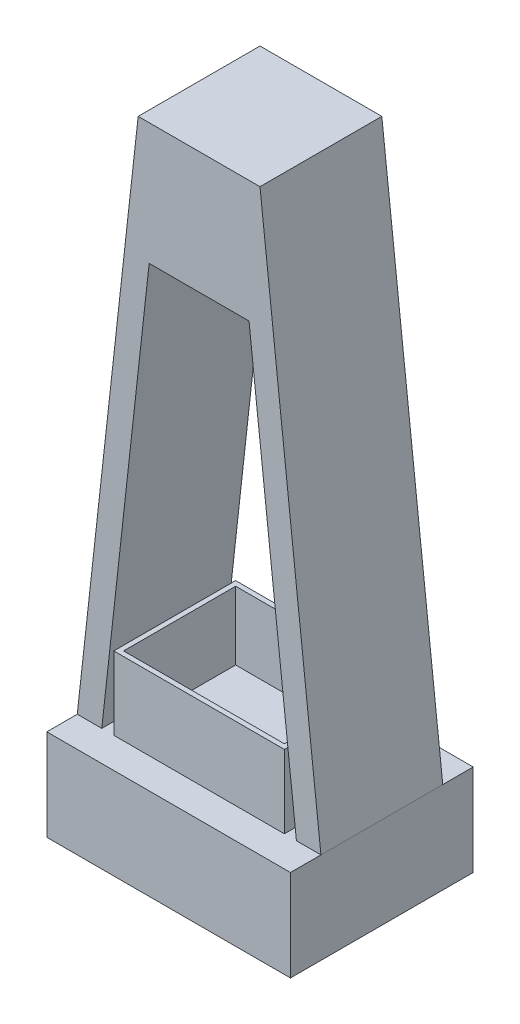
ISO-10303-21;
HEADER;
FILE_DESCRIPTION(('STEP AP214'),'2;1');
FILE_NAME('part.step','',(''),(''),'','','');
FILE_SCHEMA(('AUTOMOTIVE_DESIGN { 1 0 10303 214 1 1 1 1 }'));
ENDSEC;
DATA;
#1=APPLICATION_CONTEXT('core data for automotive mechanical design processes');
#2=APPLICATION_PROTOCOL_DEFINITION('international standard','automotive_design',2000,#1);
#3=PRODUCT_CONTEXT('',#1,'mechanical');
#4=PRODUCT('Part','Part','',(#3));
#5=PRODUCT_RELATED_PRODUCT_CATEGORY('part','',(#4));
#6=PRODUCT_DEFINITION_FORMATION('','',#4);
#7=PRODUCT_DEFINITION_CONTEXT('part definition',#1,'design');
#8=PRODUCT_DEFINITION('design','',#6,#7);
#9=PRODUCT_DEFINITION_SHAPE('','',#8);
#10=(LENGTH_UNIT() NAMED_UNIT(*) SI_UNIT(.MILLI.,.METRE.));
#11=(NAMED_UNIT(*) PLANE_ANGLE_UNIT() SI_UNIT($,.RADIAN.));
#12=(NAMED_UNIT(*) SI_UNIT($,.STERADIAN.) SOLID_ANGLE_UNIT());
#13=UNCERTAINTY_MEASURE_WITH_UNIT(LENGTH_MEASURE(1.E-05),#10,'distance_accuracy_value','');
#14=(GEOMETRIC_REPRESENTATION_CONTEXT(3) GLOBAL_UNCERTAINTY_ASSIGNED_CONTEXT((#13)) GLOBAL_UNIT_ASSIGNED_CONTEXT((#10,
#11,#12)) REPRESENTATION_CONTEXT('',''));
#15=CARTESIAN_POINT('',(0.,0.,0.));
#16=DIRECTION('',(0.,0.,1.));
#17=DIRECTION('',(1.,0.,0.));
#18=AXIS2_PLACEMENT_3D('',#15,#16,#17);
#19=CARTESIAN_POINT('',(0.,-225.,0.));
#20=DIRECTION('',(0.,1.,0.));
#21=DIRECTION('',(0.,0.,1.));
#22=AXIS2_PLACEMENT_3D('',#19,#20,#21);
#23=PLANE('',#22);
#24=DIRECTION('',(0.,0.,-1.));
#25=VECTOR('',#24,1.);
#26=CARTESIAN_POINT('',(-100.,-225.,-25.));
#27=LINE('',#26,#25);
#28=CARTESIAN_POINT('',(-100.,-225.,125.));
#29=VERTEX_POINT('',#28);
#30=CARTESIAN_POINT('',(-100.,-225.,100.));
#31=VERTEX_POINT('',#30);
#32=EDGE_CURVE('E280',#29,#31,#27,.T.);
#33=ORIENTED_EDGE('',*,*,#32,.F.);
#34=DIRECTION('',(-1.,0.,0.));
#35=VECTOR('',#34,1.);
#36=CARTESIAN_POINT('',(-100.,-225.,125.));
#37=LINE('',#36,#35);
#38=CARTESIAN_POINT('',(99.9999999999999,-225.,125.));
#39=VERTEX_POINT('',#38);
#40=EDGE_CURVE('E277',#39,#29,#37,.T.);
#41=ORIENTED_EDGE('',*,*,#40,.F.);
#42=DIRECTION('',(0.,0.,1.));
#43=VECTOR('',#42,1.);
#44=CARTESIAN_POINT('',(99.9999999999999,-225.,-25.));
#45=LINE('',#44,#43);
#46=CARTESIAN_POINT('',(100.,-225.,100.));
#47=VERTEX_POINT('',#46);
#48=EDGE_CURVE('E262',#47,#39,#45,.T.);
#49=ORIENTED_EDGE('',*,*,#48,.F.);
#50=DIRECTION('',(1.,0.,0.));
#51=VECTOR('',#50,1.);
#52=CARTESIAN_POINT('',(100.,-225.,100.));
#53=LINE('',#52,#51);
#54=CARTESIAN_POINT('',(79.8769219152501,-225.,100.));
#55=VERTEX_POINT('',#54);
#56=EDGE_CURVE('E299',#55,#47,#53,.T.);
#57=ORIENTED_EDGE('',*,*,#56,.F.);
#58=DIRECTION('',(0.,0.,-1.));
#59=VECTOR('',#58,1.);
#60=CARTESIAN_POINT('',(79.8769219152501,-225.,125.));
#61=LINE('',#60,#59);
#62=CARTESIAN_POINT('',(79.8769219152501,-225.,0.));
#63=VERTEX_POINT('',#62);
#64=EDGE_CURVE('E244',#55,#63,#61,.T.);
#65=ORIENTED_EDGE('',*,*,#64,.T.);
#66=DIRECTION('',(1.,0.,0.));
#67=VECTOR('',#66,1.);
#68=CARTESIAN_POINT('',(100.,-225.,0.));
#69=LINE('',#68,#67);
#70=CARTESIAN_POINT('',(99.9999999999999,-225.,0.));
#71=VERTEX_POINT('',#70);
#72=EDGE_CURVE('E311',#63,#71,#69,.T.);
#73=ORIENTED_EDGE('',*,*,#72,.T.);
#74=CARTESIAN_POINT('',(99.9999999999999,-225.,-25.));
#75=VERTEX_POINT('',#74);
#76=EDGE_CURVE('E274',#75,#71,#45,.T.);
#77=ORIENTED_EDGE('',*,*,#76,.F.);
#78=DIRECTION('',(1.,0.,0.));
#79=VECTOR('',#78,1.);
#80=CARTESIAN_POINT('',(-100.,-225.,-25.));
#81=LINE('',#80,#79);
#82=CARTESIAN_POINT('',(-100.,-225.,-25.));
#83=VERTEX_POINT('',#82);
#84=EDGE_CURVE('E267',#83,#75,#81,.T.);
#85=ORIENTED_EDGE('',*,*,#84,.F.);
#86=CARTESIAN_POINT('',(-100.,-225.,0.));
#87=VERTEX_POINT('',#86);
#88=EDGE_CURVE('E279',#87,#83,#27,.T.);
#89=ORIENTED_EDGE('',*,*,#88,.F.);
#90=CARTESIAN_POINT('',(-79.8769219152502,-225.,0.));
#91=VERTEX_POINT('',#90);
#92=EDGE_CURVE('E312',#87,#91,#69,.T.);
#93=ORIENTED_EDGE('',*,*,#92,.T.);
#94=DIRECTION('',(0.,0.,-1.));
#95=VECTOR('',#94,1.);
#96=CARTESIAN_POINT('',(-79.8769219152502,-225.,125.));
#97=LINE('',#96,#95);
#98=CARTESIAN_POINT('',(-79.8769219152502,-225.,100.));
#99=VERTEX_POINT('',#98);
#100=EDGE_CURVE('E250',#99,#91,#97,.T.);
#101=ORIENTED_EDGE('',*,*,#100,.F.);
#102=EDGE_CURVE('E301',#31,#99,#53,.T.);
#103=ORIENTED_EDGE('',*,*,#102,.F.);
#104=EDGE_LOOP('',(#33,#41,#49,#57,#65,#73,#77,#85,#89,#93,#101,#103));
#105=FACE_BOUND('',#104,.T.);
#106=DIRECTION('',(0.,0.,-1.));
#107=VECTOR('',#106,1.);
#108=CARTESIAN_POINT('',(-70.,-225.,252.315462117278));
#109=LINE('',#108,#107);
#110=CARTESIAN_POINT('',(-70.,-225.,100.));
#111=VERTEX_POINT('',#110);
#112=CARTESIAN_POINT('',(-70.,-225.,0.));
#113=VERTEX_POINT('',#112);
#114=EDGE_CURVE('E59',#111,#113,#109,.T.);
#115=ORIENTED_EDGE('',*,*,#114,.T.);
#116=DIRECTION('',(-1.,0.,0.));
#117=VECTOR('',#116,1.);
#118=CARTESIAN_POINT('',(70.,-225.,0.));
#119=LINE('',#118,#117);
#120=CARTESIAN_POINT('',(70.,-225.,0.));
#121=VERTEX_POINT('',#120);
#122=EDGE_CURVE('E220',#121,#113,#119,.T.);
#123=ORIENTED_EDGE('',*,*,#122,.F.);
#124=DIRECTION('',(0.,0.,-1.));
#125=VECTOR('',#124,1.);
#126=CARTESIAN_POINT('',(70.,-225.,252.315462117278));
#127=LINE('',#126,#125);
#128=CARTESIAN_POINT('',(70.,-225.,100.));
#129=VERTEX_POINT('',#128);
#130=EDGE_CURVE('E229',#129,#121,#127,.T.);
#131=ORIENTED_EDGE('',*,*,#130,.F.);
#132=DIRECTION('',(1.,0.,0.));
#133=VECTOR('',#132,1.);
#134=CARTESIAN_POINT('',(70.,-225.,100.));
#135=LINE('',#134,#133);
#136=EDGE_CURVE('E217',#111,#129,#135,.T.);
#137=ORIENTED_EDGE('',*,*,#136,.F.);
#138=EDGE_LOOP('',(#115,#123,#131,#137));
#139=FACE_BOUND('',#138,.T.);
#140=ADVANCED_FACE('F36',(#105,#139),#23,.T.);
#141=CARTESIAN_POINT('',(-100.,-225.,100.));
#142=DIRECTION('',(0.993883734673619,-0.110431526074847,0.));
#143=DIRECTION('',(0.110431526074847,0.993883734673619,0.));
#144=AXIS2_PLACEMENT_3D('',#141,#142,#143);
#145=PLANE('',#144);
#146=DIRECTION('',(-0.110431526074847,-0.993883734673619,0.));
#147=VECTOR('',#146,1.);
#148=CARTESIAN_POINT('',(-100.,-225.,0.));
#149=LINE('',#148,#147);
#150=CARTESIAN_POINT('',(-50.,225.,0.));
#151=VERTEX_POINT('',#150);
#152=EDGE_CURVE('E295',#151,#87,#149,.T.);
#153=ORIENTED_EDGE('',*,*,#152,.T.);
#154=DIRECTION('',(0.,0.,-1.));
#155=VECTOR('',#154,1.);
#156=CARTESIAN_POINT('',(-100.,-225.,100.));
#157=LINE('',#156,#155);
#158=EDGE_CURVE('E13',#31,#87,#157,.T.);
#159=ORIENTED_EDGE('',*,*,#158,.F.);
#160=DIRECTION('',(-0.110431526074847,-0.993883734673619,0.));
#161=VECTOR('',#160,1.);
#162=CARTESIAN_POINT('',(-100.,-225.,100.));
#163=LINE('',#162,#161);
#164=CARTESIAN_POINT('',(-50.,225.,100.));
#165=VERTEX_POINT('',#164);
#166=EDGE_CURVE('E296',#165,#31,#163,.T.);
#167=ORIENTED_EDGE('',*,*,#166,.F.);
#168=DIRECTION('',(0.,0.,-1.));
#169=VECTOR('',#168,1.);
#170=CARTESIAN_POINT('',(-50.,225.,100.));
#171=LINE('',#170,#169);
#172=EDGE_CURVE('E308',#165,#151,#171,.T.);
#173=ORIENTED_EDGE('',*,*,#172,.T.);
#174=EDGE_LOOP('',(#153,#159,#167,#173));
#175=FACE_BOUND('',#174,.T.);
#176=ADVANCED_FACE('F38',(#175),#145,.F.);
#177=CARTESIAN_POINT('',(50.,225.,100.));
#178=DIRECTION('',(-0.993883734673619,-0.110431526074847,0.));
#179=DIRECTION('',(0.110431526074847,-0.993883734673619,0.));
#180=AXIS2_PLACEMENT_3D('',#177,#178,#179);
#181=PLANE('',#180);
#182=DIRECTION('',(-0.110431526074847,0.993883734673619,0.));
#183=VECTOR('',#182,1.);
#184=CARTESIAN_POINT('',(50.,225.,0.));
#185=LINE('',#184,#183);
#186=CARTESIAN_POINT('',(50.,225.,0.));
#187=VERTEX_POINT('',#186);
#188=EDGE_CURVE('E315',#71,#187,#185,.T.);
#189=ORIENTED_EDGE('',*,*,#188,.T.);
#190=DIRECTION('',(0.,0.,-1.));
#191=VECTOR('',#190,1.);
#192=CARTESIAN_POINT('',(50.,225.,100.));
#193=LINE('',#192,#191);
#194=CARTESIAN_POINT('',(50.,225.,100.));
#195=VERTEX_POINT('',#194);
#196=EDGE_CURVE('E320',#195,#187,#193,.T.);
#197=ORIENTED_EDGE('',*,*,#196,.F.);
#198=DIRECTION('',(-0.110431526074847,0.993883734673619,0.));
#199=VECTOR('',#198,1.);
#200=CARTESIAN_POINT('',(50.,225.,100.));
#201=LINE('',#200,#199);
#202=EDGE_CURVE('E304',#47,#195,#201,.T.);
#203=ORIENTED_EDGE('',*,*,#202,.F.);
#204=DIRECTION('',(0.,0.,-1.));
#205=VECTOR('',#204,1.);
#206=CARTESIAN_POINT('',(100.,-225.,100.));
#207=LINE('',#206,#205);
#208=EDGE_CURVE('E44',#47,#71,#207,.T.);
#209=ORIENTED_EDGE('',*,*,#208,.T.);
#210=EDGE_LOOP('',(#189,#197,#203,#209));
#211=FACE_BOUND('',#210,.T.);
#212=ADVANCED_FACE('F327',(#211),#181,.F.);
#213=CARTESIAN_POINT('',(-50.,225.,100.));
#214=DIRECTION('',(0.,-1.,0.));
#215=DIRECTION('',(1.,0.,0.));
#216=AXIS2_PLACEMENT_3D('',#213,#214,#215);
#217=PLANE('',#216);
#218=DIRECTION('',(-1.,0.,0.));
#219=VECTOR('',#218,1.);
#220=CARTESIAN_POINT('',(-50.,225.,0.));
#221=LINE('',#220,#219);
#222=EDGE_CURVE('E300',#187,#151,#221,.T.);
#223=ORIENTED_EDGE('',*,*,#222,.T.);
#224=ORIENTED_EDGE('',*,*,#172,.F.);
#225=DIRECTION('',(-1.,0.,0.));
#226=VECTOR('',#225,1.);
#227=CARTESIAN_POINT('',(-50.,225.,100.));
#228=LINE('',#227,#226);
#229=EDGE_CURVE('E306',#195,#165,#228,.T.);
#230=ORIENTED_EDGE('',*,*,#229,.F.);
#231=ORIENTED_EDGE('',*,*,#196,.T.);
#232=EDGE_LOOP('',(#223,#224,#230,#231));
#233=FACE_BOUND('',#232,.T.);
#234=ADVANCED_FACE('F340',(#233),#217,.F.);
#235=CARTESIAN_POINT('',(0.,0.,100.));
#236=DIRECTION('',(0.,0.,-1.));
#237=DIRECTION('',(-1.,0.,0.));
#238=AXIS2_PLACEMENT_3D('',#235,#236,#237);
#239=PLANE('',#238);
#240=DIRECTION('',(1.,0.,0.));
#241=VECTOR('',#240,1.);
#242=CARTESIAN_POINT('',(0.,125.,100.));
#243=LINE('',#242,#241);
#244=CARTESIAN_POINT('',(-40.9880330263613,125.,100.));
#245=VERTEX_POINT('',#244);
#246=CARTESIAN_POINT('',(40.9880330263613,125.,100.));
#247=VERTEX_POINT('',#246);
#248=EDGE_CURVE('E259',#245,#247,#243,.T.);
#249=ORIENTED_EDGE('',*,*,#248,.T.);
#250=DIRECTION('',(0.110431526074846,-0.993883734673619,0.));
#251=VECTOR('',#250,1.);
#252=CARTESIAN_POINT('',(54.2076911601861,6.02307679557622,100.));
#253=LINE('',#252,#251);
#254=EDGE_CURVE('E256',#247,#55,#253,.T.);
#255=ORIENTED_EDGE('',*,*,#254,.T.);
#256=ORIENTED_EDGE('',*,*,#56,.T.);
#257=ORIENTED_EDGE('',*,*,#202,.T.);
#258=ORIENTED_EDGE('',*,*,#229,.T.);
#259=ORIENTED_EDGE('',*,*,#166,.T.);
#260=ORIENTED_EDGE('',*,*,#102,.T.);
#261=DIRECTION('',(0.110431526074847,0.993883734673619,0.));
#262=VECTOR('',#261,1.);
#263=CARTESIAN_POINT('',(-54.2076911601862,6.02307679557625,100.));
#264=LINE('',#263,#262);
#265=EDGE_CURVE('E247',#99,#245,#264,.T.);
#266=ORIENTED_EDGE('',*,*,#265,.T.);
#267=EDGE_LOOP('',(#249,#255,#256,#257,#258,#259,#260,#266));
#268=FACE_BOUND('',#267,.T.);
#269=ADVANCED_FACE('F346',(#268),#239,.F.);
#270=CARTESIAN_POINT('',(0.,0.,0.));
#271=DIRECTION('',(0.,0.,-1.));
#272=DIRECTION('',(-1.,0.,0.));
#273=AXIS2_PLACEMENT_3D('',#270,#271,#272);
#274=PLANE('',#273);
#275=DIRECTION('',(0.110431526074846,-0.993883734673619,0.));
#276=VECTOR('',#275,1.);
#277=CARTESIAN_POINT('',(79.8769219152501,-225.,0.));
#278=LINE('',#277,#276);
#279=CARTESIAN_POINT('',(40.9880330263613,125.,0.));
#280=VERTEX_POINT('',#279);
#281=EDGE_CURVE('E236',#280,#63,#278,.T.);
#282=ORIENTED_EDGE('',*,*,#281,.F.);
#283=DIRECTION('',(1.,0.,0.));
#284=VECTOR('',#283,1.);
#285=CARTESIAN_POINT('',(40.9880330263613,125.,0.));
#286=LINE('',#285,#284);
#287=CARTESIAN_POINT('',(-40.9880330263613,125.,0.));
#288=VERTEX_POINT('',#287);
#289=EDGE_CURVE('E241',#288,#280,#286,.T.);
#290=ORIENTED_EDGE('',*,*,#289,.F.);
#291=DIRECTION('',(0.110431526074847,0.993883734673619,0.));
#292=VECTOR('',#291,1.);
#293=CARTESIAN_POINT('',(-40.9880330263613,125.,0.));
#294=LINE('',#293,#292);
#295=EDGE_CURVE('E238',#91,#288,#294,.T.);
#296=ORIENTED_EDGE('',*,*,#295,.F.);
#297=ORIENTED_EDGE('',*,*,#92,.F.);
#298=ORIENTED_EDGE('',*,*,#152,.F.);
#299=ORIENTED_EDGE('',*,*,#222,.F.);
#300=ORIENTED_EDGE('',*,*,#188,.F.);
#301=ORIENTED_EDGE('',*,*,#72,.F.);
#302=EDGE_LOOP('',(#282,#290,#296,#297,#298,#299,#300,#301));
#303=FACE_BOUND('',#302,.T.);
#304=ADVANCED_FACE('F335',(#303),#274,.T.);
#305=CARTESIAN_POINT('',(99.9999999999999,-300.,-25.));
#306=DIRECTION('',(-1.,0.,0.));
#307=DIRECTION('',(0.,0.,1.));
#308=AXIS2_PLACEMENT_3D('',#305,#306,#307);
#309=PLANE('',#308);
#310=ORIENTED_EDGE('',*,*,#76,.T.);
#311=ORIENTED_EDGE('',*,*,#208,.F.);
#312=ORIENTED_EDGE('',*,*,#48,.T.);
#313=DIRECTION('',(0.,1.,0.));
#314=VECTOR('',#313,1.);
#315=CARTESIAN_POINT('',(99.9999999999999,-300.,125.));
#316=LINE('',#315,#314);
#317=CARTESIAN_POINT('',(99.9999999999999,-300.,125.));
#318=VERTEX_POINT('',#317);
#319=EDGE_CURVE('E292',#318,#39,#316,.T.);
#320=ORIENTED_EDGE('',*,*,#319,.F.);
#321=DIRECTION('',(0.,0.,1.));
#322=VECTOR('',#321,1.);
#323=CARTESIAN_POINT('',(99.9999999999999,-300.,-25.));
#324=LINE('',#323,#322);
#325=CARTESIAN_POINT('',(99.9999999999999,-300.,-25.));
#326=VERTEX_POINT('',#325);
#327=EDGE_CURVE('E263',#326,#318,#324,.T.);
#328=ORIENTED_EDGE('',*,*,#327,.F.);
#329=DIRECTION('',(0.,1.,0.));
#330=VECTOR('',#329,1.);
#331=CARTESIAN_POINT('',(99.9999999999999,-300.,-25.));
#332=LINE('',#331,#330);
#333=EDGE_CURVE('E273',#326,#75,#332,.T.);
#334=ORIENTED_EDGE('',*,*,#333,.T.);
#335=EDGE_LOOP('',(#310,#311,#312,#320,#328,#334));
#336=FACE_BOUND('',#335,.T.);
#337=ADVANCED_FACE('F353',(#336),#309,.F.);
#338=CARTESIAN_POINT('',(-100.,-300.,125.));
#339=DIRECTION('',(0.,0.,-1.));
#340=DIRECTION('',(-1.,0.,0.));
#341=AXIS2_PLACEMENT_3D('',#338,#339,#340);
#342=PLANE('',#341);
#343=ORIENTED_EDGE('',*,*,#40,.T.);
#344=DIRECTION('',(0.,1.,0.));
#345=VECTOR('',#344,1.);
#346=CARTESIAN_POINT('',(-100.,-300.,125.));
#347=LINE('',#346,#345);
#348=CARTESIAN_POINT('',(-100.,-300.,125.));
#349=VERTEX_POINT('',#348);
#350=EDGE_CURVE('E289',#349,#29,#347,.T.);
#351=ORIENTED_EDGE('',*,*,#350,.F.);
#352=DIRECTION('',(-1.,0.,0.));
#353=VECTOR('',#352,1.);
#354=CARTESIAN_POINT('',(-100.,-300.,125.));
#355=LINE('',#354,#353);
#356=EDGE_CURVE('E266',#318,#349,#355,.T.);
#357=ORIENTED_EDGE('',*,*,#356,.F.);
#358=ORIENTED_EDGE('',*,*,#319,.T.);
#359=EDGE_LOOP('',(#343,#351,#357,#358));
#360=FACE_BOUND('',#359,.T.);
#361=ADVANCED_FACE('F356',(#360),#342,.F.);
#362=CARTESIAN_POINT('',(-100.,-300.,-25.));
#363=DIRECTION('',(1.,0.,0.));
#364=DIRECTION('',(0.,0.,-1.));
#365=AXIS2_PLACEMENT_3D('',#362,#363,#364);
#366=PLANE('',#365);
#367=ORIENTED_EDGE('',*,*,#32,.T.);
#368=ORIENTED_EDGE('',*,*,#158,.T.);
#369=ORIENTED_EDGE('',*,*,#88,.T.);
#370=DIRECTION('',(0.,1.,0.));
#371=VECTOR('',#370,1.);
#372=CARTESIAN_POINT('',(-100.,-300.,-25.));
#373=LINE('',#372,#371);
#374=CARTESIAN_POINT('',(-100.,-300.,-25.));
#375=VERTEX_POINT('',#374);
#376=EDGE_CURVE('E286',#375,#83,#373,.T.);
#377=ORIENTED_EDGE('',*,*,#376,.F.);
#378=DIRECTION('',(0.,0.,-1.));
#379=VECTOR('',#378,1.);
#380=CARTESIAN_POINT('',(-100.,-300.,-25.));
#381=LINE('',#380,#379);
#382=EDGE_CURVE('E269',#349,#375,#381,.T.);
#383=ORIENTED_EDGE('',*,*,#382,.F.);
#384=ORIENTED_EDGE('',*,*,#350,.T.);
#385=EDGE_LOOP('',(#367,#368,#369,#377,#383,#384));
#386=FACE_BOUND('',#385,.T.);
#387=ADVANCED_FACE('F369',(#386),#366,.F.);
#388=CARTESIAN_POINT('',(-100.,-300.,-25.));
#389=DIRECTION('',(0.,0.,1.));
#390=DIRECTION('',(1.,0.,0.));
#391=AXIS2_PLACEMENT_3D('',#388,#389,#390);
#392=PLANE('',#391);
#393=ORIENTED_EDGE('',*,*,#84,.T.);
#394=ORIENTED_EDGE('',*,*,#333,.F.);
#395=DIRECTION('',(1.,0.,0.));
#396=VECTOR('',#395,1.);
#397=CARTESIAN_POINT('',(-100.,-300.,-25.));
#398=LINE('',#397,#396);
#399=EDGE_CURVE('E271',#375,#326,#398,.T.);
#400=ORIENTED_EDGE('',*,*,#399,.F.);
#401=ORIENTED_EDGE('',*,*,#376,.T.);
#402=EDGE_LOOP('',(#393,#394,#400,#401));
#403=FACE_BOUND('',#402,.T.);
#404=ADVANCED_FACE('F365',(#403),#392,.F.);
#405=CARTESIAN_POINT('',(0.,-300.,0.));
#406=DIRECTION('',(0.,1.,0.));
#407=DIRECTION('',(0.,0.,1.));
#408=AXIS2_PLACEMENT_3D('',#405,#406,#407);
#409=PLANE('',#408);
#410=ORIENTED_EDGE('',*,*,#327,.T.);
#411=ORIENTED_EDGE('',*,*,#356,.T.);
#412=ORIENTED_EDGE('',*,*,#382,.T.);
#413=ORIENTED_EDGE('',*,*,#399,.T.);
#414=EDGE_LOOP('',(#410,#411,#412,#413));
#415=FACE_BOUND('',#414,.T.);
#416=ADVANCED_FACE('F360',(#415),#409,.F.);
#417=CARTESIAN_POINT('',(40.9880330263613,125.,125.));
#418=DIRECTION('',(0.,1.,0.));
#419=DIRECTION('',(0.,0.,1.));
#420=AXIS2_PLACEMENT_3D('',#417,#418,#419);
#421=PLANE('',#420);
#422=DIRECTION('',(0.,0.,-1.));
#423=VECTOR('',#422,1.);
#424=CARTESIAN_POINT('',(-40.9880330263613,125.,125.));
#425=LINE('',#424,#423);
#426=EDGE_CURVE('E248',#245,#288,#425,.T.);
#427=ORIENTED_EDGE('',*,*,#426,.T.);
#428=ORIENTED_EDGE('',*,*,#289,.T.);
#429=DIRECTION('',(0.,0.,-1.));
#430=VECTOR('',#429,1.);
#431=CARTESIAN_POINT('',(40.9880330263613,125.,125.));
#432=LINE('',#431,#430);
#433=EDGE_CURVE('E245',#247,#280,#432,.T.);
#434=ORIENTED_EDGE('',*,*,#433,.F.);
#435=ORIENTED_EDGE('',*,*,#248,.F.);
#436=EDGE_LOOP('',(#427,#428,#434,#435));
#437=FACE_BOUND('',#436,.T.);
#438=ADVANCED_FACE('F378',(#437),#421,.F.);
#439=CARTESIAN_POINT('',(79.8769219152501,-225.,125.));
#440=DIRECTION('',(0.993883734673619,0.110431526074846,0.));
#441=DIRECTION('',(-0.110431526074846,0.993883734673619,0.));
#442=AXIS2_PLACEMENT_3D('',#439,#440,#441);
#443=PLANE('',#442);
#444=ORIENTED_EDGE('',*,*,#433,.T.);
#445=ORIENTED_EDGE('',*,*,#281,.T.);
#446=ORIENTED_EDGE('',*,*,#64,.F.);
#447=ORIENTED_EDGE('',*,*,#254,.F.);
#448=EDGE_LOOP('',(#444,#445,#446,#447));
#449=FACE_BOUND('',#448,.T.);
#450=ADVANCED_FACE('F380',(#449),#443,.F.);
#451=CARTESIAN_POINT('',(-40.9880330263613,125.,125.));
#452=DIRECTION('',(-0.993883734673619,0.110431526074847,0.));
#453=DIRECTION('',(-0.110431526074847,-0.993883734673619,0.));
#454=AXIS2_PLACEMENT_3D('',#451,#452,#453);
#455=PLANE('',#454);
#456=ORIENTED_EDGE('',*,*,#100,.T.);
#457=ORIENTED_EDGE('',*,*,#295,.T.);
#458=ORIENTED_EDGE('',*,*,#426,.F.);
#459=ORIENTED_EDGE('',*,*,#265,.F.);
#460=EDGE_LOOP('',(#456,#457,#458,#459));
#461=FACE_BOUND('',#460,.T.);
#462=ADVANCED_FACE('F374',(#461),#455,.F.);
#463=CARTESIAN_POINT('',(70.,-225.,252.315462117278));
#464=DIRECTION('',(1.,0.,0.));
#465=DIRECTION('',(0.,0.,-1.));
#466=AXIS2_PLACEMENT_3D('',#463,#464,#465);
#467=PLANE('',#466);
#468=DIRECTION('',(0.,1.,0.));
#469=VECTOR('',#468,1.);
#470=CARTESIAN_POINT('',(70.,-225.,100.));
#471=LINE('',#470,#469);
#472=CARTESIAN_POINT('',(70.,-165.,100.));
#473=VERTEX_POINT('',#472);
#474=EDGE_CURVE('E215',#129,#473,#471,.T.);
#475=ORIENTED_EDGE('',*,*,#474,.F.);
#476=ORIENTED_EDGE('',*,*,#130,.T.);
#477=DIRECTION('',(0.,-1.,0.));
#478=VECTOR('',#477,1.);
#479=CARTESIAN_POINT('',(70.,-225.,0.));
#480=LINE('',#479,#478);
#481=CARTESIAN_POINT('',(70.,-165.,0.));
#482=VERTEX_POINT('',#481);
#483=EDGE_CURVE('E208',#482,#121,#480,.T.);
#484=ORIENTED_EDGE('',*,*,#483,.F.);
#485=DIRECTION('',(0.,0.,-1.));
#486=VECTOR('',#485,1.);
#487=CARTESIAN_POINT('',(70.,-165.,252.315462117278));
#488=LINE('',#487,#486);
#489=EDGE_CURVE('E213',#473,#482,#488,.T.);
#490=ORIENTED_EDGE('',*,*,#489,.F.);
#491=EDGE_LOOP('',(#475,#476,#484,#490));
#492=FACE_BOUND('',#491,.T.);
#493=ADVANCED_FACE('F387',(#492),#467,.T.);
#494=CARTESIAN_POINT('',(70.,-165.,252.315462117278));
#495=DIRECTION('',(0.,1.,0.));
#496=DIRECTION('',(0.,0.,1.));
#497=AXIS2_PLACEMENT_3D('',#494,#495,#496);
#498=PLANE('',#497);
#499=DIRECTION('',(0.,0.,-1.));
#500=VECTOR('',#499,1.);
#501=CARTESIAN_POINT('',(66.,-165.,96.));
#502=LINE('',#501,#500);
#503=CARTESIAN_POINT('',(66.,-165.,96.));
#504=VERTEX_POINT('',#503);
#505=CARTESIAN_POINT('',(66.,-165.,4.));
#506=VERTEX_POINT('',#505);
#507=EDGE_CURVE('E51',#504,#506,#502,.T.);
#508=ORIENTED_EDGE('',*,*,#507,.F.);
#509=DIRECTION('',(1.,0.,0.));
#510=VECTOR('',#509,1.);
#511=CARTESIAN_POINT('',(-66.,-165.,96.));
#512=LINE('',#511,#510);
#513=CARTESIAN_POINT('',(-66.,-165.,96.));
#514=VERTEX_POINT('',#513);
#515=EDGE_CURVE('E197',#514,#504,#512,.T.);
#516=ORIENTED_EDGE('',*,*,#515,.F.);
#517=DIRECTION('',(0.,0.,1.));
#518=VECTOR('',#517,1.);
#519=CARTESIAN_POINT('',(-66.,-165.,96.));
#520=LINE('',#519,#518);
#521=CARTESIAN_POINT('',(-66.,-165.,4.));
#522=VERTEX_POINT('',#521);
#523=EDGE_CURVE('E180',#522,#514,#520,.T.);
#524=ORIENTED_EDGE('',*,*,#523,.F.);
#525=DIRECTION('',(-1.,0.,0.));
#526=VECTOR('',#525,1.);
#527=CARTESIAN_POINT('',(-66.,-165.,4.));
#528=LINE('',#527,#526);
#529=EDGE_CURVE('E190',#506,#522,#528,.T.);
#530=ORIENTED_EDGE('',*,*,#529,.F.);
#531=EDGE_LOOP('',(#508,#516,#524,#530));
#532=FACE_BOUND('',#531,.T.);
#533=DIRECTION('',(-1.,0.,0.));
#534=VECTOR('',#533,1.);
#535=CARTESIAN_POINT('',(70.,-165.,100.));
#536=LINE('',#535,#534);
#537=CARTESIAN_POINT('',(-70.,-165.,100.));
#538=VERTEX_POINT('',#537);
#539=EDGE_CURVE('E212',#473,#538,#536,.T.);
#540=ORIENTED_EDGE('',*,*,#539,.F.);
#541=ORIENTED_EDGE('',*,*,#489,.T.);
#542=DIRECTION('',(1.,0.,0.));
#543=VECTOR('',#542,1.);
#544=CARTESIAN_POINT('',(70.,-165.,0.));
#545=LINE('',#544,#543);
#546=CARTESIAN_POINT('',(-70.,-165.,0.));
#547=VERTEX_POINT('',#546);
#548=EDGE_CURVE('E226',#547,#482,#545,.T.);
#549=ORIENTED_EDGE('',*,*,#548,.F.);
#550=DIRECTION('',(0.,0.,-1.));
#551=VECTOR('',#550,1.);
#552=CARTESIAN_POINT('',(-70.,-165.,252.315462117278));
#553=LINE('',#552,#551);
#554=EDGE_CURVE('E231',#538,#547,#553,.T.);
#555=ORIENTED_EDGE('',*,*,#554,.F.);
#556=EDGE_LOOP('',(#540,#541,#549,#555));
#557=FACE_BOUND('',#556,.T.);
#558=ADVANCED_FACE('F194',(#532,#557),#498,.T.);
#559=CARTESIAN_POINT('',(-70.,-225.,252.315462117278));
#560=DIRECTION('',(-1.,0.,0.));
#561=DIRECTION('',(0.,-1.,0.));
#562=AXIS2_PLACEMENT_3D('',#559,#560,#561);
#563=PLANE('',#562);
#564=DIRECTION('',(0.,-1.,0.));
#565=VECTOR('',#564,1.);
#566=CARTESIAN_POINT('',(-70.,-225.,100.));
#567=LINE('',#566,#565);
#568=EDGE_CURVE('E210',#538,#111,#567,.T.);
#569=ORIENTED_EDGE('',*,*,#568,.F.);
#570=ORIENTED_EDGE('',*,*,#554,.T.);
#571=DIRECTION('',(0.,1.,0.));
#572=VECTOR('',#571,1.);
#573=CARTESIAN_POINT('',(-70.,-225.,0.));
#574=LINE('',#573,#572);
#575=EDGE_CURVE('E223',#113,#547,#574,.T.);
#576=ORIENTED_EDGE('',*,*,#575,.F.);
#577=ORIENTED_EDGE('',*,*,#114,.F.);
#578=EDGE_LOOP('',(#569,#570,#576,#577));
#579=FACE_BOUND('',#578,.T.);
#580=ADVANCED_FACE('F483',(#579),#563,.T.);
#581=CARTESIAN_POINT('',(0.,0.,0.));
#582=DIRECTION('',(0.,0.,1.));
#583=DIRECTION('',(1.,0.,0.));
#584=AXIS2_PLACEMENT_3D('',#581,#582,#583);
#585=PLANE('',#584);
#586=ORIENTED_EDGE('',*,*,#483,.T.);
#587=ORIENTED_EDGE('',*,*,#122,.T.);
#588=ORIENTED_EDGE('',*,*,#575,.T.);
#589=ORIENTED_EDGE('',*,*,#548,.T.);
#590=EDGE_LOOP('',(#586,#587,#588,#589));
#591=FACE_BOUND('',#590,.T.);
#592=ADVANCED_FACE('F488',(#591),#585,.F.);
#593=CARTESIAN_POINT('',(0.,0.,100.));
#594=DIRECTION('',(0.,0.,-1.));
#595=DIRECTION('',(-1.,0.,0.));
#596=AXIS2_PLACEMENT_3D('',#593,#594,#595);
#597=PLANE('',#596);
#598=ORIENTED_EDGE('',*,*,#474,.T.);
#599=ORIENTED_EDGE('',*,*,#539,.T.);
#600=ORIENTED_EDGE('',*,*,#568,.T.);
#601=ORIENTED_EDGE('',*,*,#136,.T.);
#602=EDGE_LOOP('',(#598,#599,#600,#601));
#603=FACE_BOUND('',#602,.T.);
#604=ADVANCED_FACE('F497',(#603),#597,.F.);
#605=CARTESIAN_POINT('',(66.,-385.89748288895,96.));
#606=DIRECTION('',(1.,0.,0.));
#607=DIRECTION('',(0.,0.,-1.));
#608=AXIS2_PLACEMENT_3D('',#605,#606,#607);
#609=PLANE('',#608);
#610=DIRECTION('',(0.,0.,1.));
#611=VECTOR('',#610,1.);
#612=CARTESIAN_POINT('',(66.,-221.,96.));
#613=LINE('',#612,#611);
#614=CARTESIAN_POINT('',(66.,-221.,4.));
#615=VERTEX_POINT('',#614);
#616=CARTESIAN_POINT('',(66.,-221.,96.));
#617=VERTEX_POINT('',#616);
#618=EDGE_CURVE('E209',#615,#617,#613,.T.);
#619=ORIENTED_EDGE('',*,*,#618,.T.);
#620=DIRECTION('',(0.,1.,0.));
#621=VECTOR('',#620,1.);
#622=CARTESIAN_POINT('',(66.,-385.89748288895,96.));
#623=LINE('',#622,#621);
#624=EDGE_CURVE('E202',#617,#504,#623,.T.);
#625=ORIENTED_EDGE('',*,*,#624,.T.);
#626=ORIENTED_EDGE('',*,*,#507,.T.);
#627=DIRECTION('',(0.,1.,0.));
#628=VECTOR('',#627,1.);
#629=CARTESIAN_POINT('',(66.,-385.89748288895,4.));
#630=LINE('',#629,#628);
#631=EDGE_CURVE('E187',#615,#506,#630,.T.);
#632=ORIENTED_EDGE('',*,*,#631,.F.);
#633=EDGE_LOOP('',(#619,#625,#626,#632));
#634=FACE_BOUND('',#633,.T.);
#635=ADVANCED_FACE('F507',(#634),#609,.F.);
#636=CARTESIAN_POINT('',(-66.,-385.89748288895,96.));
#637=DIRECTION('',(0.,0.,1.));
#638=DIRECTION('',(1.,0.,0.));
#639=AXIS2_PLACEMENT_3D('',#636,#637,#638);
#640=PLANE('',#639);
#641=DIRECTION('',(-1.,0.,0.));
#642=VECTOR('',#641,1.);
#643=CARTESIAN_POINT('',(-66.,-221.,96.));
#644=LINE('',#643,#642);
#645=CARTESIAN_POINT('',(-66.,-221.,96.));
#646=VERTEX_POINT('',#645);
#647=EDGE_CURVE('E564',#617,#646,#644,.T.);
#648=ORIENTED_EDGE('',*,*,#647,.T.);
#649=DIRECTION('',(0.,1.,0.));
#650=VECTOR('',#649,1.);
#651=CARTESIAN_POINT('',(-66.,-385.89748288895,96.));
#652=LINE('',#651,#650);
#653=EDGE_CURVE('E186',#646,#514,#652,.T.);
#654=ORIENTED_EDGE('',*,*,#653,.T.);
#655=ORIENTED_EDGE('',*,*,#515,.T.);
#656=ORIENTED_EDGE('',*,*,#624,.F.);
#657=EDGE_LOOP('',(#648,#654,#655,#656));
#658=FACE_BOUND('',#657,.T.);
#659=ADVANCED_FACE('F523',(#658),#640,.F.);
#660=CARTESIAN_POINT('',(-66.,-385.89748288895,96.));
#661=DIRECTION('',(-1.,0.,0.));
#662=DIRECTION('',(0.,0.,1.));
#663=AXIS2_PLACEMENT_3D('',#660,#661,#662);
#664=PLANE('',#663);
#665=DIRECTION('',(0.,0.,-1.));
#666=VECTOR('',#665,1.);
#667=CARTESIAN_POINT('',(-66.,-221.,96.));
#668=LINE('',#667,#666);
#669=CARTESIAN_POINT('',(-66.,-221.,4.));
#670=VERTEX_POINT('',#669);
#671=EDGE_CURVE('E183',#646,#670,#668,.T.);
#672=ORIENTED_EDGE('',*,*,#671,.T.);
#673=DIRECTION('',(0.,1.,0.));
#674=VECTOR('',#673,1.);
#675=CARTESIAN_POINT('',(-66.,-385.89748288895,4.));
#676=LINE('',#675,#674);
#677=EDGE_CURVE('E175',#670,#522,#676,.T.);
#678=ORIENTED_EDGE('',*,*,#677,.T.);
#679=ORIENTED_EDGE('',*,*,#523,.T.);
#680=ORIENTED_EDGE('',*,*,#653,.F.);
#681=EDGE_LOOP('',(#672,#678,#679,#680));
#682=FACE_BOUND('',#681,.T.);
#683=ADVANCED_FACE('F177',(#682),#664,.F.);
#684=CARTESIAN_POINT('',(-66.,-385.89748288895,4.));
#685=DIRECTION('',(0.,0.,-1.));
#686=DIRECTION('',(-1.,0.,0.));
#687=AXIS2_PLACEMENT_3D('',#684,#685,#686);
#688=PLANE('',#687);
#689=DIRECTION('',(1.,0.,0.));
#690=VECTOR('',#689,1.);
#691=CARTESIAN_POINT('',(-66.,-221.,4.));
#692=LINE('',#691,#690);
#693=EDGE_CURVE('E206',#670,#615,#692,.T.);
#694=ORIENTED_EDGE('',*,*,#693,.T.);
#695=ORIENTED_EDGE('',*,*,#631,.T.);
#696=ORIENTED_EDGE('',*,*,#529,.T.);
#697=ORIENTED_EDGE('',*,*,#677,.F.);
#698=EDGE_LOOP('',(#694,#695,#696,#697));
#699=FACE_BOUND('',#698,.T.);
#700=ADVANCED_FACE('F191',(#699),#688,.F.);
#701=CARTESIAN_POINT('',(0.,-221.,0.));
#702=DIRECTION('',(0.,1.,0.));
#703=DIRECTION('',(0.,0.,1.));
#704=AXIS2_PLACEMENT_3D('',#701,#702,#703);
#705=PLANE('',#704);
#706=ORIENTED_EDGE('',*,*,#618,.F.);
#707=ORIENTED_EDGE('',*,*,#693,.F.);
#708=ORIENTED_EDGE('',*,*,#671,.F.);
#709=ORIENTED_EDGE('',*,*,#647,.F.);
#710=EDGE_LOOP('',(#706,#707,#708,#709));
#711=FACE_BOUND('',#710,.T.);
#712=ADVANCED_FACE('F549',(#711),#705,.T.);
#713=CLOSED_SHELL('',(#140,#176,#212,#234,#269,#304,#337,#361,#387,#404,#416,#438,#450,#462,
#493,#558,#580,#592,#604,#635,#659,#683,#700,#712));
#714=MANIFOLD_SOLID_BREP('B2',#713);
#715=ADVANCED_BREP_SHAPE_REPRESENTATION('',(#18,#714),#14);
#716=SHAPE_DEFINITION_REPRESENTATION(#9,#715);
ENDSEC;
END-ISO-10303-21;
